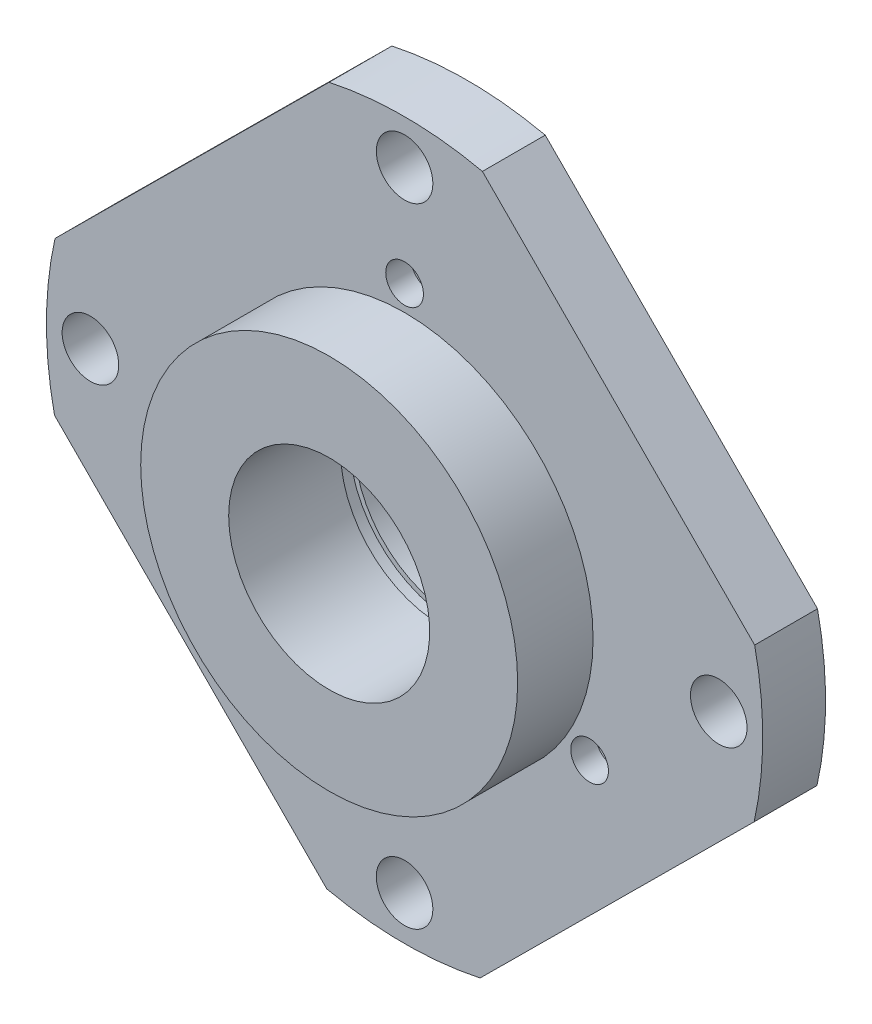
ISO-10303-21;
HEADER;
FILE_DESCRIPTION(('STEP AP214'),'2;1');
FILE_NAME('part.step','',(''),(''),'','','');
FILE_SCHEMA(('AUTOMOTIVE_DESIGN { 1 0 10303 214 1 1 1 1 }'));
ENDSEC;
DATA;
#1=APPLICATION_CONTEXT('core data for automotive mechanical design processes');
#2=APPLICATION_PROTOCOL_DEFINITION('international standard','automotive_design',2000,#1);
#3=PRODUCT_CONTEXT('',#1,'mechanical');
#4=PRODUCT('Part','Part','',(#3));
#5=PRODUCT_RELATED_PRODUCT_CATEGORY('part','',(#4));
#6=PRODUCT_DEFINITION_FORMATION('','',#4);
#7=PRODUCT_DEFINITION_CONTEXT('part definition',#1,'design');
#8=PRODUCT_DEFINITION('design','',#6,#7);
#9=PRODUCT_DEFINITION_SHAPE('','',#8);
#10=(LENGTH_UNIT() NAMED_UNIT(*) SI_UNIT(.MILLI.,.METRE.));
#11=(NAMED_UNIT(*) PLANE_ANGLE_UNIT() SI_UNIT($,.RADIAN.));
#12=(NAMED_UNIT(*) SI_UNIT($,.STERADIAN.) SOLID_ANGLE_UNIT());
#13=UNCERTAINTY_MEASURE_WITH_UNIT(LENGTH_MEASURE(1.E-05),#10,'distance_accuracy_value','');
#14=(GEOMETRIC_REPRESENTATION_CONTEXT(3) GLOBAL_UNCERTAINTY_ASSIGNED_CONTEXT((#13)) GLOBAL_UNIT_ASSIGNED_CONTEXT((#10,
#11,#12)) REPRESENTATION_CONTEXT('',''));
#15=CARTESIAN_POINT('',(0.,0.,0.));
#16=DIRECTION('',(0.,0.,1.));
#17=DIRECTION('',(1.,0.,0.));
#18=AXIS2_PLACEMENT_3D('',#15,#16,#17);
#19=CARTESIAN_POINT('',(0.,0.,0.));
#20=DIRECTION('',(0.,0.,1.));
#21=DIRECTION('',(1.,0.,0.));
#22=AXIS2_PLACEMENT_3D('',#19,#20,#21);
#23=PLANE('',#22);
#24=CARTESIAN_POINT('',(-14.7224318643355,-8.49999999999986,0.));
#25=DIRECTION('',(0.,0.,-1.));
#26=DIRECTION('',(0.499999999999992,-0.866025403784443,0.));
#27=AXIS2_PLACEMENT_3D('',#24,#25,#26);
#28=CIRCLE('',#27,2.75);
#29=CARTESIAN_POINT('',(-13.3474318643356,-10.8815698604071,0.));
#30=VERTEX_POINT('',#29);
#31=EDGE_CURVE('E211',#30,#30,#28,.T.);
#32=ORIENTED_EDGE('',*,*,#31,.F.);
#33=EDGE_LOOP('',(#32));
#34=FACE_BOUND('',#33,.T.);
#35=CARTESIAN_POINT('',(14.7224318643354,-8.50000000000007,0.));
#36=DIRECTION('',(0.,0.,-1.));
#37=DIRECTION('',(0.500000000000004,0.866025403784436,0.));
#38=AXIS2_PLACEMENT_3D('',#35,#36,#37);
#39=CIRCLE('',#38,2.75);
#40=CARTESIAN_POINT('',(16.0974318643354,-6.11843013959287,0.));
#41=VERTEX_POINT('',#40);
#42=EDGE_CURVE('E205',#41,#41,#39,.T.);
#43=ORIENTED_EDGE('',*,*,#42,.F.);
#44=EDGE_LOOP('',(#43));
#45=FACE_BOUND('',#44,.T.);
#46=CARTESIAN_POINT('',(0.,17.,0.));
#47=DIRECTION('',(0.,0.,-1.));
#48=DIRECTION('',(-1.,0.,0.));
#49=AXIS2_PLACEMENT_3D('',#46,#47,#48);
#50=CIRCLE('',#49,2.75);
#51=CARTESIAN_POINT('',(-2.75,17.,0.));
#52=VERTEX_POINT('',#51);
#53=EDGE_CURVE('E193',#52,#52,#50,.T.);
#54=ORIENTED_EDGE('',*,*,#53,.F.);
#55=EDGE_LOOP('',(#54));
#56=FACE_BOUND('',#55,.T.);
#57=CARTESIAN_POINT('',(-25.,2.61861252083204E-13,0.));
#58=DIRECTION('',(0.,0.,-1.));
#59=DIRECTION('',(0.,-1.,0.));
#60=AXIS2_PLACEMENT_3D('',#57,#58,#59);
#61=CIRCLE('',#60,2.25);
#62=CARTESIAN_POINT('',(-25.,-2.24999999999974,0.));
#63=VERTEX_POINT('',#62);
#64=EDGE_CURVE('E145',#63,#63,#61,.T.);
#65=ORIENTED_EDGE('',*,*,#64,.F.);
#66=EDGE_LOOP('',(#65));
#67=FACE_BOUND('',#66,.T.);
#68=CARTESIAN_POINT('',(-1.74574168055469E-13,-25.,0.));
#69=DIRECTION('',(0.,0.,-1.));
#70=DIRECTION('',(1.,0.,0.));
#71=AXIS2_PLACEMENT_3D('',#68,#69,#70);
#72=CIRCLE('',#71,2.25);
#73=CARTESIAN_POINT('',(2.24999999999982,-25.,0.));
#74=VERTEX_POINT('',#73);
#75=EDGE_CURVE('E144',#74,#74,#72,.T.);
#76=ORIENTED_EDGE('',*,*,#75,.F.);
#77=EDGE_LOOP('',(#76));
#78=FACE_BOUND('',#77,.T.);
#79=CARTESIAN_POINT('',(25.,0.,0.));
#80=DIRECTION('',(0.,0.,-1.));
#81=DIRECTION('',(0.,1.,0.));
#82=AXIS2_PLACEMENT_3D('',#79,#80,#81);
#83=CIRCLE('',#82,2.25);
#84=CARTESIAN_POINT('',(25.,2.24999999999991,0.));
#85=VERTEX_POINT('',#84);
#86=EDGE_CURVE('E149',#85,#85,#83,.T.);
#87=ORIENTED_EDGE('',*,*,#86,.F.);
#88=EDGE_LOOP('',(#87));
#89=FACE_BOUND('',#88,.T.);
#90=CARTESIAN_POINT('',(0.,25.,0.));
#91=DIRECTION('',(0.,0.,-1.));
#92=DIRECTION('',(-1.,0.,0.));
#93=AXIS2_PLACEMENT_3D('',#90,#91,#92);
#94=CIRCLE('',#93,2.25);
#95=CARTESIAN_POINT('',(-2.25,25.,0.));
#96=VERTEX_POINT('',#95);
#97=EDGE_CURVE('E153',#96,#96,#94,.T.);
#98=ORIENTED_EDGE('',*,*,#97,.F.);
#99=EDGE_LOOP('',(#98));
#100=FACE_BOUND('',#99,.T.);
#101=CARTESIAN_POINT('',(0.,0.,0.));
#102=DIRECTION('',(0.,0.,1.));
#103=DIRECTION('',(1.,0.,0.));
#104=AXIS2_PLACEMENT_3D('',#101,#102,#103);
#105=CIRCLE('',#104,12.5);
#106=CARTESIAN_POINT('',(12.5,0.,0.));
#107=VERTEX_POINT('',#106);
#108=EDGE_CURVE('E163',#107,#107,#105,.F.);
#109=ORIENTED_EDGE('',*,*,#108,.F.);
#110=EDGE_LOOP('',(#109));
#111=FACE_BOUND('',#110,.T.);
#112=DIRECTION('',(-0.709409416019854,-0.704796623475432,0.));
#113=VECTOR('',#112,1.);
#114=CARTESIAN_POINT('',(-16.9151189634104,17.0258259844765,0.));
#115=LINE('',#114,#113);
#116=CARTESIAN_POINT('',(-6.01119392511502,27.8588504356275,0.));
#117=VERTEX_POINT('',#116);
#118=CARTESIAN_POINT('',(-27.8190440017058,6.19280153332554,0.));
#119=VERTEX_POINT('',#118);
#120=EDGE_CURVE('E54',#117,#119,#115,.T.);
#121=ORIENTED_EDGE('',*,*,#120,.F.);
#122=CARTESIAN_POINT('',(0.,0.,0.));
#123=DIRECTION('',(0.,0.,1.));
#124=DIRECTION('',(1.,0.,0.));
#125=AXIS2_PLACEMENT_3D('',#122,#123,#124);
#126=CIRCLE('',#125,28.5);
#127=CARTESIAN_POINT('',(6.19280153332524,27.8190440017058,0.));
#128=VERTEX_POINT('',#127);
#129=EDGE_CURVE('E167',#128,#117,#126,.T.);
#130=ORIENTED_EDGE('',*,*,#129,.F.);
#131=DIRECTION('',(-0.70479662347544,0.709409416019846,0.));
#132=VECTOR('',#131,1.);
#133=CARTESIAN_POINT('',(17.0258259844763,16.9151189634106,0.));
#134=LINE('',#133,#132);
#135=CARTESIAN_POINT('',(27.8588504356274,6.0111939251153,0.));
#136=VERTEX_POINT('',#135);
#137=EDGE_CURVE('E230',#136,#128,#134,.T.);
#138=ORIENTED_EDGE('',*,*,#137,.F.);
#139=CARTESIAN_POINT('',(27.8190440017058,-6.19280153332534,0.));
#140=VERTEX_POINT('',#139);
#141=EDGE_CURVE('E170',#140,#136,#126,.T.);
#142=ORIENTED_EDGE('',*,*,#141,.F.);
#143=DIRECTION('',(0.709409416019849,0.704796623475437,0.));
#144=VECTOR('',#143,1.);
#145=CARTESIAN_POINT('',(16.9151189634105,-17.0258259844764,0.));
#146=LINE('',#145,#144);
#147=CARTESIAN_POINT('',(6.0111939251152,-27.8588504356274,0.));
#148=VERTEX_POINT('',#147);
#149=EDGE_CURVE('E235',#148,#140,#146,.T.);
#150=ORIENTED_EDGE('',*,*,#149,.F.);
#151=CARTESIAN_POINT('',(-6.19280153332543,-27.8190440017058,0.));
#152=VERTEX_POINT('',#151);
#153=EDGE_CURVE('E253',#152,#148,#126,.T.);
#154=ORIENTED_EDGE('',*,*,#153,.F.);
#155=DIRECTION('',(0.704796623475435,-0.709409416019851,0.));
#156=VECTOR('',#155,1.);
#157=CARTESIAN_POINT('',(-17.0258259844764,-16.9151189634104,0.));
#158=LINE('',#157,#156);
#159=CARTESIAN_POINT('',(-27.8588504356274,-6.0111939251151,0.));
#160=VERTEX_POINT('',#159);
#161=EDGE_CURVE('E241',#160,#152,#158,.T.);
#162=ORIENTED_EDGE('',*,*,#161,.F.);
#163=EDGE_CURVE('E169',#119,#160,#126,.T.);
#164=ORIENTED_EDGE('',*,*,#163,.F.);
#165=EDGE_LOOP('',(#121,#130,#138,#142,#150,#154,#162,#164));
#166=FACE_BOUND('',#165,.T.);
#167=ADVANCED_FACE('F33',(#34,#45,#56,#67,#78,#89,#100,#111,#166),#23,.F.);
#168=CARTESIAN_POINT('',(0.,0.,5.));
#169=DIRECTION('',(0.,0.,1.));
#170=DIRECTION('',(1.,0.,0.));
#171=AXIS2_PLACEMENT_3D('',#168,#169,#170);
#172=PLANE('',#171);
#173=CARTESIAN_POINT('',(-14.7224318643355,-8.49999999999986,5.));
#174=DIRECTION('',(0.,0.,1.));
#175=DIRECTION('',(1.,0.,0.));
#176=AXIS2_PLACEMENT_3D('',#173,#174,#175);
#177=CIRCLE('',#176,1.5);
#178=CARTESIAN_POINT('',(-13.2224318643355,-8.49999999999986,5.));
#179=VERTEX_POINT('',#178);
#180=EDGE_CURVE('E220',#179,#179,#177,.T.);
#181=ORIENTED_EDGE('',*,*,#180,.F.);
#182=EDGE_LOOP('',(#181));
#183=FACE_BOUND('',#182,.T.);
#184=CARTESIAN_POINT('',(14.7224318643354,-8.50000000000007,5.));
#185=DIRECTION('',(0.,0.,1.));
#186=DIRECTION('',(1.,0.,0.));
#187=AXIS2_PLACEMENT_3D('',#184,#185,#186);
#188=CIRCLE('',#187,1.5);
#189=CARTESIAN_POINT('',(16.2224318643354,-8.50000000000007,5.));
#190=VERTEX_POINT('',#189);
#191=EDGE_CURVE('E214',#190,#190,#188,.T.);
#192=ORIENTED_EDGE('',*,*,#191,.F.);
#193=EDGE_LOOP('',(#192));
#194=FACE_BOUND('',#193,.T.);
#195=CARTESIAN_POINT('',(0.,17.,5.));
#196=DIRECTION('',(0.,0.,1.));
#197=DIRECTION('',(1.,0.,0.));
#198=AXIS2_PLACEMENT_3D('',#195,#196,#197);
#199=CIRCLE('',#198,1.5);
#200=CARTESIAN_POINT('',(1.5,17.,5.));
#201=VERTEX_POINT('',#200);
#202=EDGE_CURVE('E196',#201,#201,#199,.T.);
#203=ORIENTED_EDGE('',*,*,#202,.F.);
#204=EDGE_LOOP('',(#203));
#205=FACE_BOUND('',#204,.T.);
#206=CARTESIAN_POINT('',(-25.,2.61861252083204E-13,5.));
#207=DIRECTION('',(0.,0.,1.));
#208=DIRECTION('',(1.,0.,0.));
#209=AXIS2_PLACEMENT_3D('',#206,#207,#208);
#210=CIRCLE('',#209,2.25);
#211=CARTESIAN_POINT('',(-22.75,2.61861252083204E-13,5.));
#212=VERTEX_POINT('',#211);
#213=EDGE_CURVE('E141',#212,#212,#210,.T.);
#214=ORIENTED_EDGE('',*,*,#213,.F.);
#215=EDGE_LOOP('',(#214));
#216=FACE_BOUND('',#215,.T.);
#217=CARTESIAN_POINT('',(-1.74574168055469E-13,-25.,5.));
#218=DIRECTION('',(0.,0.,1.));
#219=DIRECTION('',(1.,0.,0.));
#220=AXIS2_PLACEMENT_3D('',#217,#218,#219);
#221=CIRCLE('',#220,2.25);
#222=CARTESIAN_POINT('',(2.24999999999982,-25.,5.));
#223=VERTEX_POINT('',#222);
#224=EDGE_CURVE('E146',#223,#223,#221,.T.);
#225=ORIENTED_EDGE('',*,*,#224,.F.);
#226=EDGE_LOOP('',(#225));
#227=FACE_BOUND('',#226,.T.);
#228=CARTESIAN_POINT('',(25.,0.,5.));
#229=DIRECTION('',(0.,0.,1.));
#230=DIRECTION('',(1.,0.,0.));
#231=AXIS2_PLACEMENT_3D('',#228,#229,#230);
#232=CIRCLE('',#231,2.25);
#233=CARTESIAN_POINT('',(27.25,0.,5.));
#234=VERTEX_POINT('',#233);
#235=EDGE_CURVE('E150',#234,#234,#232,.T.);
#236=ORIENTED_EDGE('',*,*,#235,.F.);
#237=EDGE_LOOP('',(#236));
#238=FACE_BOUND('',#237,.T.);
#239=CARTESIAN_POINT('',(0.,25.,5.));
#240=DIRECTION('',(0.,0.,1.));
#241=DIRECTION('',(1.,0.,0.));
#242=AXIS2_PLACEMENT_3D('',#239,#240,#241);
#243=CIRCLE('',#242,2.25);
#244=CARTESIAN_POINT('',(2.25,25.,5.));
#245=VERTEX_POINT('',#244);
#246=EDGE_CURVE('E154',#245,#245,#243,.T.);
#247=ORIENTED_EDGE('',*,*,#246,.F.);
#248=EDGE_LOOP('',(#247));
#249=FACE_BOUND('',#248,.T.);
#250=CARTESIAN_POINT('',(0.,0.,5.));
#251=DIRECTION('',(0.,0.,1.));
#252=DIRECTION('',(1.,0.,0.));
#253=AXIS2_PLACEMENT_3D('',#250,#251,#252);
#254=CIRCLE('',#253,15.);
#255=CARTESIAN_POINT('',(15.,0.,5.));
#256=VERTEX_POINT('',#255);
#257=EDGE_CURVE('E174',#256,#256,#254,.T.);
#258=ORIENTED_EDGE('',*,*,#257,.F.);
#259=EDGE_LOOP('',(#258));
#260=FACE_BOUND('',#259,.T.);
#261=CARTESIAN_POINT('',(0.,0.,5.));
#262=DIRECTION('',(0.,0.,1.));
#263=DIRECTION('',(1.,0.,0.));
#264=AXIS2_PLACEMENT_3D('',#261,#262,#263);
#265=CIRCLE('',#264,28.5);
#266=CARTESIAN_POINT('',(6.19280153332523,27.8190440017058,5.));
#267=VERTEX_POINT('',#266);
#268=CARTESIAN_POINT('',(-6.01119392511502,27.8588504356275,5.));
#269=VERTEX_POINT('',#268);
#270=EDGE_CURVE('E104',#267,#269,#265,.T.);
#271=ORIENTED_EDGE('',*,*,#270,.T.);
#272=DIRECTION('',(-0.709409416019854,-0.704796623475432,0.));
#273=VECTOR('',#272,1.);
#274=CARTESIAN_POINT('',(-16.9151189634104,17.0258259844765,5.));
#275=LINE('',#274,#273);
#276=CARTESIAN_POINT('',(-27.8190440017058,6.19280153332552,5.));
#277=VERTEX_POINT('',#276);
#278=EDGE_CURVE('E109',#269,#277,#275,.T.);
#279=ORIENTED_EDGE('',*,*,#278,.T.);
#280=CARTESIAN_POINT('',(-27.8588504356274,-6.0111939251151,5.));
#281=VERTEX_POINT('',#280);
#282=EDGE_CURVE('E96',#277,#281,#265,.T.);
#283=ORIENTED_EDGE('',*,*,#282,.T.);
#284=DIRECTION('',(0.704796623475435,-0.709409416019851,0.));
#285=VECTOR('',#284,1.);
#286=CARTESIAN_POINT('',(-17.0258259844764,-16.9151189634104,5.));
#287=LINE('',#286,#285);
#288=CARTESIAN_POINT('',(-6.19280153332543,-27.8190440017058,5.));
#289=VERTEX_POINT('',#288);
#290=EDGE_CURVE('E244',#281,#289,#287,.T.);
#291=ORIENTED_EDGE('',*,*,#290,.T.);
#292=CARTESIAN_POINT('',(6.0111939251152,-27.8588504356274,5.));
#293=VERTEX_POINT('',#292);
#294=EDGE_CURVE('E105',#289,#293,#265,.T.);
#295=ORIENTED_EDGE('',*,*,#294,.T.);
#296=DIRECTION('',(0.709409416019849,0.704796623475437,0.));
#297=VECTOR('',#296,1.);
#298=CARTESIAN_POINT('',(16.9151189634105,-17.0258259844764,5.));
#299=LINE('',#298,#297);
#300=CARTESIAN_POINT('',(27.8190440017058,-6.19280153332533,5.));
#301=VERTEX_POINT('',#300);
#302=EDGE_CURVE('E238',#293,#301,#299,.T.);
#303=ORIENTED_EDGE('',*,*,#302,.T.);
#304=CARTESIAN_POINT('',(27.8588504356274,6.0111939251153,5.));
#305=VERTEX_POINT('',#304);
#306=EDGE_CURVE('E166',#301,#305,#265,.T.);
#307=ORIENTED_EDGE('',*,*,#306,.T.);
#308=DIRECTION('',(-0.70479662347544,0.709409416019846,0.));
#309=VECTOR('',#308,1.);
#310=CARTESIAN_POINT('',(17.0258259844763,16.9151189634106,5.));
#311=LINE('',#310,#309);
#312=EDGE_CURVE('E233',#305,#267,#311,.T.);
#313=ORIENTED_EDGE('',*,*,#312,.T.);
#314=EDGE_LOOP('',(#271,#279,#283,#291,#295,#303,#307,#313));
#315=FACE_BOUND('',#314,.T.);
#316=ADVANCED_FACE('F110',(#183,#194,#205,#216,#227,#238,#249,#260,#315),#172,.T.);
#317=CARTESIAN_POINT('',(0.,0.,5.));
#318=DIRECTION('',(0.,0.,-1.));
#319=DIRECTION('',(-1.,0.,0.));
#320=AXIS2_PLACEMENT_3D('',#317,#318,#319);
#321=CYLINDRICAL_SURFACE('',#320,28.5);
#322=DIRECTION('',(0.,0.,-1.));
#323=VECTOR('',#322,1.);
#324=CARTESIAN_POINT('',(-6.01119392511502,27.8588504356275,5.));
#325=LINE('',#324,#323);
#326=EDGE_CURVE('E11',#269,#117,#325,.T.);
#327=ORIENTED_EDGE('',*,*,#326,.F.);
#328=ORIENTED_EDGE('',*,*,#270,.F.);
#329=DIRECTION('',(0.,0.,-1.));
#330=VECTOR('',#329,1.);
#331=CARTESIAN_POINT('',(6.19280153332524,27.8190440017058,5.));
#332=LINE('',#331,#330);
#333=EDGE_CURVE('E129',#128,#267,#332,.F.);
#334=ORIENTED_EDGE('',*,*,#333,.F.);
#335=ORIENTED_EDGE('',*,*,#129,.T.);
#336=EDGE_LOOP('',(#327,#328,#334,#335));
#337=FACE_BOUND('',#336,.T.);
#338=ADVANCED_FACE('F35',(#337),#321,.T.);
#339=DIRECTION('',(0.,0.,-1.));
#340=VECTOR('',#339,1.);
#341=CARTESIAN_POINT('',(-27.8190440017058,6.19280153332554,5.));
#342=LINE('',#341,#340);
#343=EDGE_CURVE('E41',#119,#277,#342,.F.);
#344=ORIENTED_EDGE('',*,*,#343,.F.);
#345=ORIENTED_EDGE('',*,*,#163,.T.);
#346=DIRECTION('',(0.,0.,-1.));
#347=VECTOR('',#346,1.);
#348=CARTESIAN_POINT('',(-27.8588504356274,-6.0111939251151,5.));
#349=LINE('',#348,#347);
#350=EDGE_CURVE('E100',#281,#160,#349,.T.);
#351=ORIENTED_EDGE('',*,*,#350,.F.);
#352=ORIENTED_EDGE('',*,*,#282,.F.);
#353=EDGE_LOOP('',(#344,#345,#351,#352));
#354=FACE_BOUND('',#353,.T.);
#355=ADVANCED_FACE('F98',(#354),#321,.T.);
#356=DIRECTION('',(0.,0.,-1.));
#357=VECTOR('',#356,1.);
#358=CARTESIAN_POINT('',(-6.19280153332543,-27.8190440017058,5.));
#359=LINE('',#358,#357);
#360=EDGE_CURVE('E115',#152,#289,#359,.F.);
#361=ORIENTED_EDGE('',*,*,#360,.F.);
#362=ORIENTED_EDGE('',*,*,#153,.T.);
#363=DIRECTION('',(0.,0.,-1.));
#364=VECTOR('',#363,1.);
#365=CARTESIAN_POINT('',(6.0111939251152,-27.8588504356274,5.));
#366=LINE('',#365,#364);
#367=EDGE_CURVE('E120',#293,#148,#366,.T.);
#368=ORIENTED_EDGE('',*,*,#367,.F.);
#369=ORIENTED_EDGE('',*,*,#294,.F.);
#370=EDGE_LOOP('',(#361,#362,#368,#369));
#371=FACE_BOUND('',#370,.T.);
#372=ADVANCED_FACE('F252',(#371),#321,.T.);
#373=DIRECTION('',(0.,0.,-1.));
#374=VECTOR('',#373,1.);
#375=CARTESIAN_POINT('',(27.8190440017058,-6.19280153332534,5.));
#376=LINE('',#375,#374);
#377=EDGE_CURVE('E123',#140,#301,#376,.F.);
#378=ORIENTED_EDGE('',*,*,#377,.F.);
#379=ORIENTED_EDGE('',*,*,#141,.T.);
#380=DIRECTION('',(0.,0.,-1.));
#381=VECTOR('',#380,1.);
#382=CARTESIAN_POINT('',(27.8588504356274,6.0111939251153,5.));
#383=LINE('',#382,#381);
#384=EDGE_CURVE('E126',#305,#136,#383,.T.);
#385=ORIENTED_EDGE('',*,*,#384,.F.);
#386=ORIENTED_EDGE('',*,*,#306,.F.);
#387=EDGE_LOOP('',(#378,#379,#385,#386));
#388=FACE_BOUND('',#387,.T.);
#389=ADVANCED_FACE('F259',(#388),#321,.T.);
#390=CARTESIAN_POINT('',(0.,0.,11.));
#391=DIRECTION('',(0.,0.,-1.));
#392=DIRECTION('',(-1.,0.,0.));
#393=AXIS2_PLACEMENT_3D('',#390,#391,#392);
#394=CYLINDRICAL_SURFACE('',#393,8.);
#395=CARTESIAN_POINT('',(0.,0.,11.));
#396=DIRECTION('',(0.,0.,-1.));
#397=DIRECTION('',(-1.,0.,0.));
#398=AXIS2_PLACEMENT_3D('',#395,#396,#397);
#399=CIRCLE('',#398,8.);
#400=CARTESIAN_POINT('',(-8.,0.,11.));
#401=VERTEX_POINT('',#400);
#402=EDGE_CURVE('E177',#401,#401,#399,.T.);
#403=CARTESIAN_POINT('',(0.,0.,2.1));
#404=DIRECTION('',(0.,0.,-1.));
#405=DIRECTION('',(-1.,0.,0.));
#406=AXIS2_PLACEMENT_3D('',#403,#404,#405);
#407=CIRCLE('',#406,8.);
#408=CARTESIAN_POINT('',(-8.,0.,2.1));
#409=VERTEX_POINT('',#408);
#410=EDGE_CURVE('E133',#409,#409,#407,.F.);
#411=CARTESIAN_POINT('',(-8.,0.,11.));
#412=CARTESIAN_POINT('',(-8.,0.,10.9072916666667));
#413=CARTESIAN_POINT('',(-8.,0.,10.8145833333333));
#414=CARTESIAN_POINT('',(-8.,0.,10.6291666666667));
#415=CARTESIAN_POINT('',(-8.,0.,10.5364583333333));
#416=CARTESIAN_POINT('',(-8.,0.,10.3510416666667));
#417=CARTESIAN_POINT('',(-8.,0.,10.2583333333333));
#418=CARTESIAN_POINT('',(-8.,0.,10.0729166666667));
#419=CARTESIAN_POINT('',(-8.,0.,9.98020833333333));
#420=CARTESIAN_POINT('',(-8.,0.,9.79479166666667));
#421=CARTESIAN_POINT('',(-8.,0.,9.70208333333333));
#422=CARTESIAN_POINT('',(-8.,0.,9.51666666666667));
#423=CARTESIAN_POINT('',(-8.,0.,9.42395833333333));
#424=CARTESIAN_POINT('',(-8.,0.,9.23854166666667));
#425=CARTESIAN_POINT('',(-8.,0.,9.14583333333333));
#426=CARTESIAN_POINT('',(-8.,0.,8.96041666666667));
#427=CARTESIAN_POINT('',(-8.,0.,8.86770833333333));
#428=CARTESIAN_POINT('',(-8.,0.,8.68229166666667));
#429=CARTESIAN_POINT('',(-8.,0.,8.58958333333334));
#430=CARTESIAN_POINT('',(-8.,0.,8.40416666666667));
#431=CARTESIAN_POINT('',(-8.,0.,8.31145833333333));
#432=CARTESIAN_POINT('',(-8.,0.,8.12604166666667));
#433=CARTESIAN_POINT('',(-8.,0.,8.03333333333333));
#434=CARTESIAN_POINT('',(-8.,0.,7.84791666666667));
#435=CARTESIAN_POINT('',(-8.,0.,7.75520833333333));
#436=CARTESIAN_POINT('',(-8.,0.,7.56979166666667));
#437=CARTESIAN_POINT('',(-8.,0.,7.47708333333333));
#438=CARTESIAN_POINT('',(-8.,0.,7.29166666666667));
#439=CARTESIAN_POINT('',(-8.,0.,7.19895833333333));
#440=CARTESIAN_POINT('',(-8.,0.,7.01354166666667));
#441=CARTESIAN_POINT('',(-8.,0.,6.92083333333333));
#442=CARTESIAN_POINT('',(-8.,0.,6.73541666666667));
#443=CARTESIAN_POINT('',(-8.,0.,6.64270833333333));
#444=CARTESIAN_POINT('',(-8.,0.,6.45729166666667));
#445=CARTESIAN_POINT('',(-8.,0.,6.36458333333333));
#446=CARTESIAN_POINT('',(-8.,0.,6.17916666666667));
#447=CARTESIAN_POINT('',(-8.,0.,6.08645833333333));
#448=CARTESIAN_POINT('',(-8.,0.,5.90104166666667));
#449=CARTESIAN_POINT('',(-8.,0.,5.80833333333333));
#450=CARTESIAN_POINT('',(-8.,0.,5.62291666666667));
#451=CARTESIAN_POINT('',(-8.,0.,5.53020833333334));
#452=CARTESIAN_POINT('',(-8.,0.,5.34479166666667));
#453=CARTESIAN_POINT('',(-8.,0.,5.25208333333333));
#454=CARTESIAN_POINT('',(-8.,0.,5.06666666666667));
#455=CARTESIAN_POINT('',(-8.,0.,4.97395833333333));
#456=CARTESIAN_POINT('',(-8.,0.,4.78854166666667));
#457=CARTESIAN_POINT('',(-8.,0.,4.69583333333333));
#458=CARTESIAN_POINT('',(-8.,0.,4.51041666666667));
#459=CARTESIAN_POINT('',(-8.,0.,4.41770833333333));
#460=CARTESIAN_POINT('',(-8.,0.,4.23229166666667));
#461=CARTESIAN_POINT('',(-8.,0.,4.13958333333333));
#462=CARTESIAN_POINT('',(-8.,0.,3.95416666666667));
#463=CARTESIAN_POINT('',(-8.,0.,3.86145833333333));
#464=CARTESIAN_POINT('',(-8.,0.,3.67604166666667));
#465=CARTESIAN_POINT('',(-8.,0.,3.58333333333333));
#466=CARTESIAN_POINT('',(-8.,0.,3.39791666666667));
#467=CARTESIAN_POINT('',(-8.,0.,3.30520833333333));
#468=CARTESIAN_POINT('',(-8.,0.,3.11979166666667));
#469=CARTESIAN_POINT('',(-8.,0.,3.02708333333334));
#470=CARTESIAN_POINT('',(-8.,0.,2.84166666666667));
#471=CARTESIAN_POINT('',(-8.,0.,2.74895833333334));
#472=CARTESIAN_POINT('',(-8.,0.,2.56354166666667));
#473=CARTESIAN_POINT('',(-8.,0.,2.47083333333334));
#474=CARTESIAN_POINT('',(-8.,0.,2.28541666666667));
#475=CARTESIAN_POINT('',(-8.,0.,2.19270833333334));
#476=CARTESIAN_POINT('',(-8.,0.,2.1));
#477=B_SPLINE_CURVE_WITH_KNOTS('',3,(#411,#412,#413,#414,#415,#416,#417,#418,#419,#420,#421,
#422,#423,#424,#425,#426,#427,#428,#429,#430,#431,#432,#433,#434,#435,#436,#437,#438,#439,#440,
#441,#442,#443,#444,#445,#446,#447,#448,#449,#450,#451,#452,#453,#454,#455,#456,#457,#458,#459,
#460,#461,#462,#463,#464,#465,#466,#467,#468,#469,#470,#471,#472,#473,#474,#475,#476),
.UNSPECIFIED.,.F.,.F.,(4,2,2,2,2,2,2,2,2,2,2,2,2,2,2,2,2,2,2,2,2,2,2,2,2,2,2,2,2,2,2,2,4),(0.,
0.278125000000001,0.556250000000001,0.834375,1.1125,1.390625,1.66875,1.946875,2.225,2.503125,
2.78125,3.059375,3.3375,3.615625,3.89375,4.171875,4.45,4.728125,5.00625,5.284375,5.5625,
5.840625,6.11875,6.396875,6.675,6.953125,7.23125,7.509375,7.7875,8.065625,8.34375,8.621875,8.9),.UNSPECIFIED.);
#478=EDGE_CURVE('BSEAM289',#401,#409,#477,.T.);
#479=ORIENTED_EDGE('',*,*,#402,.F.);
#480=ORIENTED_EDGE('',*,*,#410,.F.);
#481=ORIENTED_EDGE('',*,*,#478,.T.);
#482=ORIENTED_EDGE('',*,*,#478,.F.);
#483=EDGE_LOOP('',(#479,#481,#480,#482));
#484=FACE_BOUND('',#483,.T.);
#485=ADVANCED_FACE('F289',(#484),#394,.F.);
#486=CARTESIAN_POINT('',(0.,0.,11.));
#487=DIRECTION('',(0.,0.,-1.));
#488=DIRECTION('',(-1.,0.,0.));
#489=AXIS2_PLACEMENT_3D('',#486,#487,#488);
#490=CYLINDRICAL_SURFACE('',#489,15.);
#491=CARTESIAN_POINT('',(0.,0.,11.));
#492=DIRECTION('',(0.,0.,1.));
#493=DIRECTION('',(1.,0.,0.));
#494=AXIS2_PLACEMENT_3D('',#491,#492,#493);
#495=CIRCLE('',#494,15.);
#496=CARTESIAN_POINT('',(15.,0.,11.));
#497=VERTEX_POINT('',#496);
#498=EDGE_CURVE('E171',#497,#497,#495,.T.);
#499=ORIENTED_EDGE('',*,*,#498,.F.);
#500=EDGE_LOOP('',(#499));
#501=FACE_BOUND('',#500,.T.);
#502=ORIENTED_EDGE('',*,*,#257,.T.);
#503=EDGE_LOOP('',(#502));
#504=FACE_BOUND('',#503,.T.);
#505=ADVANCED_FACE('F285',(#501,#504),#490,.T.);
#506=CARTESIAN_POINT('',(0.,0.,11.));
#507=DIRECTION('',(0.,0.,1.));
#508=DIRECTION('',(1.,0.,0.));
#509=AXIS2_PLACEMENT_3D('',#506,#507,#508);
#510=PLANE('',#509);
#511=ORIENTED_EDGE('',*,*,#402,.T.);
#512=EDGE_LOOP('',(#511));
#513=FACE_BOUND('',#512,.T.);
#514=ORIENTED_EDGE('',*,*,#498,.T.);
#515=EDGE_LOOP('',(#514));
#516=FACE_BOUND('',#515,.T.);
#517=ADVANCED_FACE('F288',(#513,#516),#510,.T.);
#518=CARTESIAN_POINT('',(0.,0.,-3.));
#519=DIRECTION('',(0.,0.,1.));
#520=DIRECTION('',(1.,0.,0.));
#521=AXIS2_PLACEMENT_3D('',#518,#519,#520);
#522=CYLINDRICAL_SURFACE('',#521,12.5);
#523=CARTESIAN_POINT('',(0.,0.,-2.5));
#524=DIRECTION('',(0.,0.,-1.));
#525=DIRECTION('',(-1.,0.,0.));
#526=AXIS2_PLACEMENT_3D('',#523,#524,#525);
#527=CIRCLE('',#526,12.5);
#528=CARTESIAN_POINT('',(-12.5,0.,-2.5));
#529=VERTEX_POINT('',#528);
#530=EDGE_CURVE('E132',#529,#529,#527,.F.);
#531=ORIENTED_EDGE('',*,*,#530,.T.);
#532=EDGE_LOOP('',(#531));
#533=FACE_BOUND('',#532,.T.);
#534=ORIENTED_EDGE('',*,*,#108,.T.);
#535=EDGE_LOOP('',(#534));
#536=FACE_BOUND('',#535,.T.);
#537=ADVANCED_FACE('F293',(#533,#536),#522,.T.);
#538=CARTESIAN_POINT('',(0.,0.,-3.));
#539=DIRECTION('',(0.,0.,-1.));
#540=DIRECTION('',(-1.,0.,0.));
#541=AXIS2_PLACEMENT_3D('',#538,#539,#540);
#542=PLANE('',#541);
#543=CARTESIAN_POINT('',(0.,0.,-3.));
#544=DIRECTION('',(0.,0.,-1.));
#545=DIRECTION('',(-1.,0.,0.));
#546=AXIS2_PLACEMENT_3D('',#543,#544,#545);
#547=CIRCLE('',#546,8.);
#548=CARTESIAN_POINT('',(-8.,0.,-3.));
#549=VERTEX_POINT('',#548);
#550=EDGE_CURVE('E157',#549,#549,#547,.T.);
#551=ORIENTED_EDGE('',*,*,#550,.F.);
#552=EDGE_LOOP('',(#551));
#553=FACE_BOUND('',#552,.T.);
#554=CARTESIAN_POINT('',(0.,0.,-3.));
#555=DIRECTION('',(0.,0.,-1.));
#556=DIRECTION('',(-1.,0.,0.));
#557=AXIS2_PLACEMENT_3D('',#554,#555,#556);
#558=CIRCLE('',#557,12.);
#559=CARTESIAN_POINT('',(-12.,0.,-3.));
#560=VERTEX_POINT('',#559);
#561=EDGE_CURVE('E160',#560,#560,#558,.T.);
#562=ORIENTED_EDGE('',*,*,#561,.T.);
#563=EDGE_LOOP('',(#562));
#564=FACE_BOUND('',#563,.T.);
#565=ADVANCED_FACE('F297',(#553,#564),#542,.T.);
#566=CARTESIAN_POINT('',(0.,0.,-3.));
#567=DIRECTION('',(0.,0.,1.));
#568=DIRECTION('',(1.,0.,0.));
#569=AXIS2_PLACEMENT_3D('',#566,#567,#568);
#570=CONICAL_SURFACE('',#569,12.,0.785398163397454);
#571=ORIENTED_EDGE('',*,*,#530,.F.);
#572=EDGE_LOOP('',(#571));
#573=FACE_BOUND('',#572,.T.);
#574=ORIENTED_EDGE('',*,*,#561,.F.);
#575=EDGE_LOOP('',(#574));
#576=FACE_BOUND('',#575,.T.);
#577=ADVANCED_FACE('F301',(#573,#576),#570,.T.);
#578=CARTESIAN_POINT('',(0.,0.,1.));
#579=DIRECTION('',(0.,0.,-1.));
#580=DIRECTION('',(-1.,0.,0.));
#581=AXIS2_PLACEMENT_3D('',#578,#579,#580);
#582=CIRCLE('',#581,8.);
#583=CARTESIAN_POINT('',(-8.,0.,1.));
#584=VERTEX_POINT('',#583);
#585=EDGE_CURVE('E137',#584,#584,#582,.F.);
#586=CARTESIAN_POINT('',(-8.,0.,1.));
#587=CARTESIAN_POINT('',(-8.,0.,0.958333333333336));
#588=CARTESIAN_POINT('',(-8.,0.,0.916666666666669));
#589=CARTESIAN_POINT('',(-8.,0.,0.833333333333336));
#590=CARTESIAN_POINT('',(-8.,0.,0.791666666666669));
#591=CARTESIAN_POINT('',(-8.,0.,0.708333333333336));
#592=CARTESIAN_POINT('',(-8.,0.,0.666666666666669));
#593=CARTESIAN_POINT('',(-8.,0.,0.583333333333336));
#594=CARTESIAN_POINT('',(-8.,0.,0.541666666666669));
#595=CARTESIAN_POINT('',(-8.,0.,0.458333333333335));
#596=CARTESIAN_POINT('',(-8.,0.,0.416666666666669));
#597=CARTESIAN_POINT('',(-8.,0.,0.333333333333335));
#598=CARTESIAN_POINT('',(-8.,0.,0.291666666666669));
#599=CARTESIAN_POINT('',(-8.,0.,0.208333333333335));
#600=CARTESIAN_POINT('',(-8.,0.,0.166666666666669));
#601=CARTESIAN_POINT('',(-8.,0.,0.0833333333333351));
#602=CARTESIAN_POINT('',(-8.,0.,0.0416666666666684));
#603=CARTESIAN_POINT('',(-8.,0.,-0.041666666666665));
#604=CARTESIAN_POINT('',(-8.,0.,-0.0833333333333317));
#605=CARTESIAN_POINT('',(-8.,0.,-0.166666666666665));
#606=CARTESIAN_POINT('',(-8.,0.,-0.208333333333332));
#607=CARTESIAN_POINT('',(-8.,0.,-0.291666666666665));
#608=CARTESIAN_POINT('',(-8.,0.,-0.333333333333332));
#609=CARTESIAN_POINT('',(-8.,0.,-0.416666666666665));
#610=CARTESIAN_POINT('',(-8.,0.,-0.458333333333332));
#611=CARTESIAN_POINT('',(-8.,0.,-0.541666666666665));
#612=CARTESIAN_POINT('',(-8.,0.,-0.583333333333332));
#613=CARTESIAN_POINT('',(-8.,0.,-0.666666666666666));
#614=CARTESIAN_POINT('',(-8.,0.,-0.708333333333332));
#615=CARTESIAN_POINT('',(-8.,0.,-0.791666666666666));
#616=CARTESIAN_POINT('',(-8.,0.,-0.833333333333332));
#617=CARTESIAN_POINT('',(-8.,0.,-0.916666666666666));
#618=CARTESIAN_POINT('',(-8.,0.,-0.958333333333332));
#619=CARTESIAN_POINT('',(-8.,0.,-1.04166666666667));
#620=CARTESIAN_POINT('',(-8.,0.,-1.08333333333333));
#621=CARTESIAN_POINT('',(-8.,0.,-1.16666666666667));
#622=CARTESIAN_POINT('',(-8.,0.,-1.20833333333333));
#623=CARTESIAN_POINT('',(-8.,0.,-1.29166666666667));
#624=CARTESIAN_POINT('',(-8.,0.,-1.33333333333333));
#625=CARTESIAN_POINT('',(-8.,0.,-1.41666666666667));
#626=CARTESIAN_POINT('',(-8.,0.,-1.45833333333333));
#627=CARTESIAN_POINT('',(-8.,0.,-1.54166666666667));
#628=CARTESIAN_POINT('',(-8.,0.,-1.58333333333333));
#629=CARTESIAN_POINT('',(-8.,0.,-1.66666666666667));
#630=CARTESIAN_POINT('',(-8.,0.,-1.70833333333333));
#631=CARTESIAN_POINT('',(-8.,0.,-1.79166666666667));
#632=CARTESIAN_POINT('',(-8.,0.,-1.83333333333333));
#633=CARTESIAN_POINT('',(-8.,0.,-1.91666666666667));
#634=CARTESIAN_POINT('',(-8.,0.,-1.95833333333333));
#635=CARTESIAN_POINT('',(-8.,0.,-2.04166666666667));
#636=CARTESIAN_POINT('',(-8.,0.,-2.08333333333333));
#637=CARTESIAN_POINT('',(-8.,0.,-2.16666666666667));
#638=CARTESIAN_POINT('',(-8.,0.,-2.20833333333333));
#639=CARTESIAN_POINT('',(-8.,0.,-2.29166666666667));
#640=CARTESIAN_POINT('',(-8.,0.,-2.33333333333333));
#641=CARTESIAN_POINT('',(-8.,0.,-2.41666666666667));
#642=CARTESIAN_POINT('',(-8.,0.,-2.45833333333333));
#643=CARTESIAN_POINT('',(-8.,0.,-2.54166666666667));
#644=CARTESIAN_POINT('',(-8.,0.,-2.58333333333333));
#645=CARTESIAN_POINT('',(-8.,0.,-2.66666666666667));
#646=CARTESIAN_POINT('',(-8.,0.,-2.70833333333333));
#647=CARTESIAN_POINT('',(-8.,0.,-2.79166666666667));
#648=CARTESIAN_POINT('',(-8.,0.,-2.83333333333333));
#649=CARTESIAN_POINT('',(-8.,0.,-2.91666666666667));
#650=CARTESIAN_POINT('',(-8.,0.,-2.95833333333333));
#651=CARTESIAN_POINT('',(-8.,0.,-3.));
#652=B_SPLINE_CURVE_WITH_KNOTS('',3,(#586,#587,#588,#589,#590,#591,#592,#593,#594,#595,#596,
#597,#598,#599,#600,#601,#602,#603,#604,#605,#606,#607,#608,#609,#610,#611,#612,#613,#614,#615,
#616,#617,#618,#619,#620,#621,#622,#623,#624,#625,#626,#627,#628,#629,#630,#631,#632,#633,#634,
#635,#636,#637,#638,#639,#640,#641,#642,#643,#644,#645,#646,#647,#648,#649,#650,#651),
.UNSPECIFIED.,.F.,.F.,(4,2,2,2,2,2,2,2,2,2,2,2,2,2,2,2,2,2,2,2,2,2,2,2,2,2,2,2,2,2,2,2,4),(0.,
0.125,0.25,0.375,0.5,0.625000000000001,0.750000000000001,0.875000000000001,1.,1.125,1.25,1.375,
1.5,1.625,1.75,1.875,2.,2.125,2.25,2.375,2.5,2.625,2.75,2.875,3.,3.125,3.25,3.375,3.5,3.625,
3.75,3.875,4.),.UNSPECIFIED.);
#653=EDGE_CURVE('BSEAM305',#584,#549,#652,.T.);
#654=ORIENTED_EDGE('',*,*,#585,.T.);
#655=ORIENTED_EDGE('',*,*,#550,.T.);
#656=ORIENTED_EDGE('',*,*,#653,.T.);
#657=ORIENTED_EDGE('',*,*,#653,.F.);
#658=EDGE_LOOP('',(#654,#656,#655,#657));
#659=FACE_BOUND('',#658,.T.);
#660=ADVANCED_FACE('F305',(#659),#394,.F.);
#661=CARTESIAN_POINT('',(0.,25.,11.));
#662=DIRECTION('',(0.,0.,-1.));
#663=DIRECTION('',(-1.,0.,0.));
#664=AXIS2_PLACEMENT_3D('',#661,#662,#663);
#665=CYLINDRICAL_SURFACE('',#664,2.25);
#666=ORIENTED_EDGE('',*,*,#246,.T.);
#667=EDGE_LOOP('',(#666));
#668=FACE_BOUND('',#667,.T.);
#669=ORIENTED_EDGE('',*,*,#97,.T.);
#670=EDGE_LOOP('',(#669));
#671=FACE_BOUND('',#670,.T.);
#672=ADVANCED_FACE('F309',(#668,#671),#665,.F.);
#673=CARTESIAN_POINT('',(25.,0.,11.));
#674=DIRECTION('',(0.,0.,-1.));
#675=DIRECTION('',(-1.,0.,0.));
#676=AXIS2_PLACEMENT_3D('',#673,#674,#675);
#677=CYLINDRICAL_SURFACE('',#676,2.25);
#678=ORIENTED_EDGE('',*,*,#235,.T.);
#679=EDGE_LOOP('',(#678));
#680=FACE_BOUND('',#679,.T.);
#681=ORIENTED_EDGE('',*,*,#86,.T.);
#682=EDGE_LOOP('',(#681));
#683=FACE_BOUND('',#682,.T.);
#684=ADVANCED_FACE('F313',(#680,#683),#677,.F.);
#685=CARTESIAN_POINT('',(-1.74574168055469E-13,-25.,11.));
#686=DIRECTION('',(0.,0.,-1.));
#687=DIRECTION('',(-1.,0.,0.));
#688=AXIS2_PLACEMENT_3D('',#685,#686,#687);
#689=CYLINDRICAL_SURFACE('',#688,2.25);
#690=ORIENTED_EDGE('',*,*,#224,.T.);
#691=EDGE_LOOP('',(#690));
#692=FACE_BOUND('',#691,.T.);
#693=ORIENTED_EDGE('',*,*,#75,.T.);
#694=EDGE_LOOP('',(#693));
#695=FACE_BOUND('',#694,.T.);
#696=ADVANCED_FACE('F317',(#692,#695),#689,.F.);
#697=CARTESIAN_POINT('',(-25.,2.61861252083204E-13,11.));
#698=DIRECTION('',(0.,0.,-1.));
#699=DIRECTION('',(-1.,0.,0.));
#700=AXIS2_PLACEMENT_3D('',#697,#698,#699);
#701=CYLINDRICAL_SURFACE('',#700,2.25);
#702=ORIENTED_EDGE('',*,*,#213,.T.);
#703=EDGE_LOOP('',(#702));
#704=FACE_BOUND('',#703,.T.);
#705=ORIENTED_EDGE('',*,*,#64,.T.);
#706=EDGE_LOOP('',(#705));
#707=FACE_BOUND('',#706,.T.);
#708=ADVANCED_FACE('F321',(#704,#707),#701,.F.);
#709=CARTESIAN_POINT('',(0.,17.,3.));
#710=DIRECTION('',(0.,0.,-1.));
#711=DIRECTION('',(-1.,0.,0.));
#712=AXIS2_PLACEMENT_3D('',#709,#710,#711);
#713=CYLINDRICAL_SURFACE('',#712,2.75);
#714=CARTESIAN_POINT('',(0.,17.,3.));
#715=DIRECTION('',(0.,0.,-1.));
#716=DIRECTION('',(-1.,0.,0.));
#717=AXIS2_PLACEMENT_3D('',#714,#715,#716);
#718=CIRCLE('',#717,2.75);
#719=CARTESIAN_POINT('',(-2.75,17.,3.));
#720=VERTEX_POINT('',#719);
#721=EDGE_CURVE('E190',#720,#720,#718,.T.);
#722=ORIENTED_EDGE('',*,*,#721,.F.);
#723=EDGE_LOOP('',(#722));
#724=FACE_BOUND('',#723,.T.);
#725=ORIENTED_EDGE('',*,*,#53,.T.);
#726=EDGE_LOOP('',(#725));
#727=FACE_BOUND('',#726,.T.);
#728=ADVANCED_FACE('F325',(#724,#727),#713,.F.);
#729=CARTESIAN_POINT('',(0.,17.,3.));
#730=DIRECTION('',(0.,0.,-1.));
#731=DIRECTION('',(-1.,0.,0.));
#732=AXIS2_PLACEMENT_3D('',#729,#730,#731);
#733=PLANE('',#732);
#734=CARTESIAN_POINT('',(0.,17.,3.));
#735=DIRECTION('',(0.,0.,-1.));
#736=DIRECTION('',(-1.,0.,0.));
#737=AXIS2_PLACEMENT_3D('',#734,#735,#736);
#738=CIRCLE('',#737,1.5);
#739=CARTESIAN_POINT('',(-1.5,17.,3.));
#740=VERTEX_POINT('',#739);
#741=EDGE_CURVE('E199',#740,#740,#738,.T.);
#742=ORIENTED_EDGE('',*,*,#741,.F.);
#743=EDGE_LOOP('',(#742));
#744=FACE_BOUND('',#743,.T.);
#745=ORIENTED_EDGE('',*,*,#721,.T.);
#746=EDGE_LOOP('',(#745));
#747=FACE_BOUND('',#746,.T.);
#748=ADVANCED_FACE('F329',(#744,#747),#733,.T.);
#749=CARTESIAN_POINT('',(0.,17.,11.));
#750=DIRECTION('',(0.,0.,-1.));
#751=DIRECTION('',(-1.,0.,0.));
#752=AXIS2_PLACEMENT_3D('',#749,#750,#751);
#753=CYLINDRICAL_SURFACE('',#752,1.5);
#754=ORIENTED_EDGE('',*,*,#202,.T.);
#755=EDGE_LOOP('',(#754));
#756=FACE_BOUND('',#755,.T.);
#757=ORIENTED_EDGE('',*,*,#741,.T.);
#758=EDGE_LOOP('',(#757));
#759=FACE_BOUND('',#758,.T.);
#760=ADVANCED_FACE('F333',(#756,#759),#753,.F.);
#761=CARTESIAN_POINT('',(14.7224318643354,-8.50000000000007,3.));
#762=DIRECTION('',(0.,0.,-1.));
#763=DIRECTION('',(-1.,0.,0.));
#764=AXIS2_PLACEMENT_3D('',#761,#762,#763);
#765=CYLINDRICAL_SURFACE('',#764,2.75);
#766=CARTESIAN_POINT('',(14.7224318643354,-8.50000000000007,3.));
#767=DIRECTION('',(0.,0.,-1.));
#768=DIRECTION('',(0.500000000000004,0.866025403784436,0.));
#769=AXIS2_PLACEMENT_3D('',#766,#767,#768);
#770=CIRCLE('',#769,2.75);
#771=CARTESIAN_POINT('',(16.0974318643354,-6.11843013959287,3.));
#772=VERTEX_POINT('',#771);
#773=EDGE_CURVE('E202',#772,#772,#770,.T.);
#774=ORIENTED_EDGE('',*,*,#773,.F.);
#775=EDGE_LOOP('',(#774));
#776=FACE_BOUND('',#775,.T.);
#777=ORIENTED_EDGE('',*,*,#42,.T.);
#778=EDGE_LOOP('',(#777));
#779=FACE_BOUND('',#778,.T.);
#780=ADVANCED_FACE('F337',(#776,#779),#765,.F.);
#781=CARTESIAN_POINT('',(14.7224318643354,-8.50000000000007,3.));
#782=DIRECTION('',(0.,0.,-1.));
#783=DIRECTION('',(0.500000000000004,0.866025403784436,0.));
#784=AXIS2_PLACEMENT_3D('',#781,#782,#783);
#785=PLANE('',#784);
#786=CARTESIAN_POINT('',(14.7224318643354,-8.50000000000007,3.));
#787=DIRECTION('',(0.,0.,-1.));
#788=DIRECTION('',(0.500000000000004,0.866025403784436,0.));
#789=AXIS2_PLACEMENT_3D('',#786,#787,#788);
#790=CIRCLE('',#789,1.5);
#791=CARTESIAN_POINT('',(15.4724318643354,-7.20096189432341,3.));
#792=VERTEX_POINT('',#791);
#793=EDGE_CURVE('E217',#792,#792,#790,.T.);
#794=ORIENTED_EDGE('',*,*,#793,.F.);
#795=EDGE_LOOP('',(#794));
#796=FACE_BOUND('',#795,.T.);
#797=ORIENTED_EDGE('',*,*,#773,.T.);
#798=EDGE_LOOP('',(#797));
#799=FACE_BOUND('',#798,.T.);
#800=ADVANCED_FACE('F341',(#796,#799),#785,.T.);
#801=CARTESIAN_POINT('',(-14.7224318643355,-8.49999999999986,3.));
#802=DIRECTION('',(0.,0.,-1.));
#803=DIRECTION('',(-1.,0.,0.));
#804=AXIS2_PLACEMENT_3D('',#801,#802,#803);
#805=CYLINDRICAL_SURFACE('',#804,2.75);
#806=CARTESIAN_POINT('',(-14.7224318643355,-8.49999999999986,3.));
#807=DIRECTION('',(0.,0.,-1.));
#808=DIRECTION('',(0.499999999999992,-0.866025403784443,0.));
#809=AXIS2_PLACEMENT_3D('',#806,#807,#808);
#810=CIRCLE('',#809,2.75);
#811=CARTESIAN_POINT('',(-13.3474318643356,-10.8815698604071,3.));
#812=VERTEX_POINT('',#811);
#813=EDGE_CURVE('E208',#812,#812,#810,.T.);
#814=ORIENTED_EDGE('',*,*,#813,.F.);
#815=EDGE_LOOP('',(#814));
#816=FACE_BOUND('',#815,.T.);
#817=ORIENTED_EDGE('',*,*,#31,.T.);
#818=EDGE_LOOP('',(#817));
#819=FACE_BOUND('',#818,.T.);
#820=ADVANCED_FACE('F345',(#816,#819),#805,.F.);
#821=CARTESIAN_POINT('',(-14.7224318643355,-8.49999999999986,3.));
#822=DIRECTION('',(0.,0.,-1.));
#823=DIRECTION('',(0.499999999999992,-0.866025403784443,0.));
#824=AXIS2_PLACEMENT_3D('',#821,#822,#823);
#825=PLANE('',#824);
#826=CARTESIAN_POINT('',(-14.7224318643355,-8.49999999999986,3.));
#827=DIRECTION('',(0.,0.,-1.));
#828=DIRECTION('',(0.499999999999992,-0.866025403784443,0.));
#829=AXIS2_PLACEMENT_3D('',#826,#827,#828);
#830=CIRCLE('',#829,1.5);
#831=CARTESIAN_POINT('',(-13.9724318643355,-9.79903810567653,3.));
#832=VERTEX_POINT('',#831);
#833=EDGE_CURVE('E136',#832,#832,#830,.T.);
#834=ORIENTED_EDGE('',*,*,#833,.F.);
#835=EDGE_LOOP('',(#834));
#836=FACE_BOUND('',#835,.T.);
#837=ORIENTED_EDGE('',*,*,#813,.T.);
#838=EDGE_LOOP('',(#837));
#839=FACE_BOUND('',#838,.T.);
#840=ADVANCED_FACE('F349',(#836,#839),#825,.T.);
#841=CARTESIAN_POINT('',(14.7224318643354,-8.50000000000007,11.));
#842=DIRECTION('',(0.,0.,-1.));
#843=DIRECTION('',(-1.,0.,0.));
#844=AXIS2_PLACEMENT_3D('',#841,#842,#843);
#845=CYLINDRICAL_SURFACE('',#844,1.5);
#846=ORIENTED_EDGE('',*,*,#191,.T.);
#847=EDGE_LOOP('',(#846));
#848=FACE_BOUND('',#847,.T.);
#849=ORIENTED_EDGE('',*,*,#793,.T.);
#850=EDGE_LOOP('',(#849));
#851=FACE_BOUND('',#850,.T.);
#852=ADVANCED_FACE('F353',(#848,#851),#845,.F.);
#853=CARTESIAN_POINT('',(-14.7224318643355,-8.49999999999986,11.));
#854=DIRECTION('',(0.,0.,-1.));
#855=DIRECTION('',(-1.,0.,0.));
#856=AXIS2_PLACEMENT_3D('',#853,#854,#855);
#857=CYLINDRICAL_SURFACE('',#856,1.5);
#858=ORIENTED_EDGE('',*,*,#180,.T.);
#859=EDGE_LOOP('',(#858));
#860=FACE_BOUND('',#859,.T.);
#861=ORIENTED_EDGE('',*,*,#833,.T.);
#862=EDGE_LOOP('',(#861));
#863=FACE_BOUND('',#862,.T.);
#864=ADVANCED_FACE('F357',(#860,#863),#857,.F.);
#865=CARTESIAN_POINT('',(0.,0.,2.1));
#866=DIRECTION('',(0.,0.,-1.));
#867=DIRECTION('',(-1.,0.,0.));
#868=AXIS2_PLACEMENT_3D('',#865,#866,#867);
#869=PLANE('',#868);
#870=CARTESIAN_POINT('',(0.,0.,2.1));
#871=DIRECTION('',(0.,0.,-1.));
#872=DIRECTION('',(-1.,0.,0.));
#873=AXIS2_PLACEMENT_3D('',#870,#871,#872);
#874=CIRCLE('',#873,8.4);
#875=CARTESIAN_POINT('',(-8.4,0.,2.1));
#876=VERTEX_POINT('',#875);
#877=EDGE_CURVE('E140',#876,#876,#874,.T.);
#878=ORIENTED_EDGE('',*,*,#877,.T.);
#879=EDGE_LOOP('',(#878));
#880=FACE_BOUND('',#879,.T.);
#881=ORIENTED_EDGE('',*,*,#410,.T.);
#882=EDGE_LOOP('',(#881));
#883=FACE_BOUND('',#882,.T.);
#884=ADVANCED_FACE('F361',(#880,#883),#869,.T.);
#885=CARTESIAN_POINT('',(0.,0.,1.));
#886=DIRECTION('',(0.,0.,-1.));
#887=DIRECTION('',(-1.,0.,0.));
#888=AXIS2_PLACEMENT_3D('',#885,#886,#887);
#889=PLANE('',#888);
#890=CARTESIAN_POINT('',(0.,0.,1.));
#891=DIRECTION('',(0.,0.,-1.));
#892=DIRECTION('',(-1.,0.,0.));
#893=AXIS2_PLACEMENT_3D('',#890,#891,#892);
#894=CIRCLE('',#893,8.4);
#895=CARTESIAN_POINT('',(-8.4,0.,1.));
#896=VERTEX_POINT('',#895);
#897=EDGE_CURVE('E227',#896,#896,#894,.T.);
#898=ORIENTED_EDGE('',*,*,#897,.F.);
#899=EDGE_LOOP('',(#898));
#900=FACE_BOUND('',#899,.T.);
#901=ORIENTED_EDGE('',*,*,#585,.F.);
#902=EDGE_LOOP('',(#901));
#903=FACE_BOUND('',#902,.T.);
#904=ADVANCED_FACE('F365',(#900,#903),#889,.F.);
#905=CARTESIAN_POINT('',(0.,0.,2.1));
#906=DIRECTION('',(0.,0.,-1.));
#907=DIRECTION('',(-1.,0.,0.));
#908=AXIS2_PLACEMENT_3D('',#905,#906,#907);
#909=CYLINDRICAL_SURFACE('',#908,8.4);
#910=ORIENTED_EDGE('',*,*,#877,.F.);
#911=EDGE_LOOP('',(#910));
#912=FACE_BOUND('',#911,.T.);
#913=ORIENTED_EDGE('',*,*,#897,.T.);
#914=EDGE_LOOP('',(#913));
#915=FACE_BOUND('',#914,.T.);
#916=ADVANCED_FACE('F273',(#912,#915),#909,.F.);
#917=CARTESIAN_POINT('',(27.8588504356274,6.0111939251153,-102.271085845414));
#918=DIRECTION('',(0.709409416019846,0.70479662347544,0.));
#919=DIRECTION('',(-0.70479662347544,0.709409416019846,0.));
#920=AXIS2_PLACEMENT_3D('',#917,#918,#919);
#921=PLANE('',#920);
#922=ORIENTED_EDGE('',*,*,#384,.T.);
#923=ORIENTED_EDGE('',*,*,#137,.T.);
#924=ORIENTED_EDGE('',*,*,#333,.T.);
#925=ORIENTED_EDGE('',*,*,#312,.F.);
#926=EDGE_LOOP('',(#922,#923,#924,#925));
#927=FACE_BOUND('',#926,.T.);
#928=ADVANCED_FACE('F262',(#927),#921,.T.);
#929=CARTESIAN_POINT('',(6.0111939251152,-27.8588504356274,-102.271085845414));
#930=DIRECTION('',(0.704796623475437,-0.709409416019849,0.));
#931=DIRECTION('',(0.709409416019849,0.704796623475437,0.));
#932=AXIS2_PLACEMENT_3D('',#929,#930,#931);
#933=PLANE('',#932);
#934=ORIENTED_EDGE('',*,*,#367,.T.);
#935=ORIENTED_EDGE('',*,*,#149,.T.);
#936=ORIENTED_EDGE('',*,*,#377,.T.);
#937=ORIENTED_EDGE('',*,*,#302,.F.);
#938=EDGE_LOOP('',(#934,#935,#936,#937));
#939=FACE_BOUND('',#938,.T.);
#940=ADVANCED_FACE('F265',(#939),#933,.T.);
#941=CARTESIAN_POINT('',(-27.8588504356274,-6.0111939251151,-102.271085845414));
#942=DIRECTION('',(-0.709409416019851,-0.704796623475435,0.));
#943=DIRECTION('',(0.704796623475435,-0.709409416019851,0.));
#944=AXIS2_PLACEMENT_3D('',#941,#942,#943);
#945=PLANE('',#944);
#946=ORIENTED_EDGE('',*,*,#350,.T.);
#947=ORIENTED_EDGE('',*,*,#161,.T.);
#948=ORIENTED_EDGE('',*,*,#360,.T.);
#949=ORIENTED_EDGE('',*,*,#290,.F.);
#950=EDGE_LOOP('',(#946,#947,#948,#949));
#951=FACE_BOUND('',#950,.T.);
#952=ADVANCED_FACE('F248',(#951),#945,.T.);
#953=CARTESIAN_POINT('',(-6.01119392511501,27.8588504356275,-102.271085845414));
#954=DIRECTION('',(-0.704796623475432,0.709409416019854,0.));
#955=DIRECTION('',(-0.709409416019854,-0.704796623475432,0.));
#956=AXIS2_PLACEMENT_3D('',#953,#954,#955);
#957=PLANE('',#956);
#958=ORIENTED_EDGE('',*,*,#326,.T.);
#959=ORIENTED_EDGE('',*,*,#120,.T.);
#960=ORIENTED_EDGE('',*,*,#343,.T.);
#961=ORIENTED_EDGE('',*,*,#278,.F.);
#962=EDGE_LOOP('',(#958,#959,#960,#961));
#963=FACE_BOUND('',#962,.T.);
#964=ADVANCED_FACE('F114',(#963),#957,.T.);
#965=CLOSED_SHELL('',(#167,#316,#338,#355,#372,#389,#485,#505,#517,#537,#565,#577,#660,#672,
#684,#696,#708,#728,#748,#760,#780,#800,#820,#840,#852,#864,#884,#904,#916,#928,#940,#952,#964));
#966=MANIFOLD_SOLID_BREP('B2',#965);
#967=ADVANCED_BREP_SHAPE_REPRESENTATION('',(#18,#966),#14);
#968=SHAPE_DEFINITION_REPRESENTATION(#9,#967);
ENDSEC;
END-ISO-10303-21;
